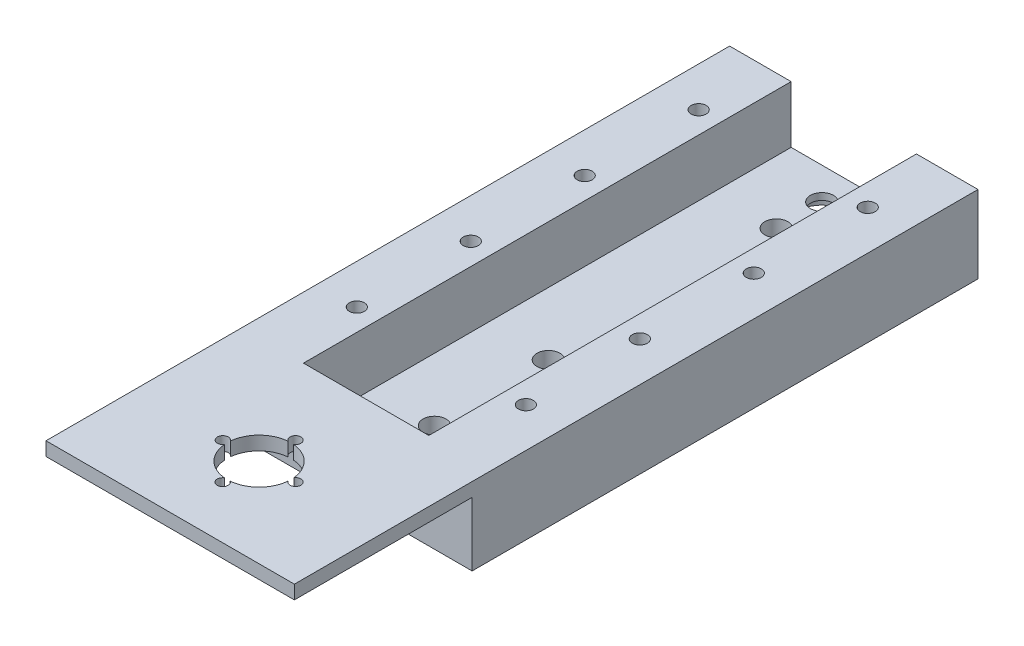
ISO-10303-21;
HEADER;
FILE_DESCRIPTION(('STEP AP214'),'2;1');
FILE_NAME('part.step','',(''),(''),'','','');
FILE_SCHEMA(('AUTOMOTIVE_DESIGN { 1 0 10303 214 1 1 1 1 }'));
ENDSEC;
DATA;
#1=APPLICATION_CONTEXT('core data for automotive mechanical design processes');
#2=APPLICATION_PROTOCOL_DEFINITION('international standard','automotive_design',2000,#1);
#3=PRODUCT_CONTEXT('',#1,'mechanical');
#4=PRODUCT('Part','Part','',(#3));
#5=PRODUCT_RELATED_PRODUCT_CATEGORY('part','',(#4));
#6=PRODUCT_DEFINITION_FORMATION('','',#4);
#7=PRODUCT_DEFINITION_CONTEXT('part definition',#1,'design');
#8=PRODUCT_DEFINITION('design','',#6,#7);
#9=PRODUCT_DEFINITION_SHAPE('','',#8);
#10=(LENGTH_UNIT() NAMED_UNIT(*) SI_UNIT(.MILLI.,.METRE.));
#11=(NAMED_UNIT(*) PLANE_ANGLE_UNIT() SI_UNIT($,.RADIAN.));
#12=(NAMED_UNIT(*) SI_UNIT($,.STERADIAN.) SOLID_ANGLE_UNIT());
#13=UNCERTAINTY_MEASURE_WITH_UNIT(LENGTH_MEASURE(1.E-05),#10,'distance_accuracy_value','');
#14=(GEOMETRIC_REPRESENTATION_CONTEXT(3) GLOBAL_UNCERTAINTY_ASSIGNED_CONTEXT((#13)) GLOBAL_UNIT_ASSIGNED_CONTEXT((#10,
#11,#12)) REPRESENTATION_CONTEXT('',''));
#15=CARTESIAN_POINT('',(0.,0.,0.));
#16=DIRECTION('',(0.,0.,1.));
#17=DIRECTION('',(1.,0.,0.));
#18=AXIS2_PLACEMENT_3D('',#15,#16,#17);
#19=CARTESIAN_POINT('',(-13.3995438408786,4.5,-92.6293125841432));
#20=DIRECTION('',(0.,1.,0.));
#21=DIRECTION('',(0.,0.,1.));
#22=AXIS2_PLACEMENT_3D('',#19,#20,#21);
#23=CYLINDRICAL_SURFACE('',#22,2.5273);
#24=CARTESIAN_POINT('',(-13.3995438408786,4.5,-92.6293125841432));
#25=DIRECTION('',(0.,1.,0.));
#26=DIRECTION('',(0.,0.,1.));
#27=AXIS2_PLACEMENT_3D('',#24,#25,#26);
#28=CIRCLE('',#27,2.5273);
#29=CARTESIAN_POINT('',(-13.3995438408786,4.5,-90.1020125841432));
#30=VERTEX_POINT('',#29);
#31=EDGE_CURVE('E165',#30,#30,#28,.T.);
#32=ORIENTED_EDGE('',*,*,#31,.T.);
#33=EDGE_LOOP('',(#32));
#34=FACE_BOUND('',#33,.T.);
#35=CARTESIAN_POINT('',(-13.3995438408786,3.,-92.6293125841432));
#36=DIRECTION('',(0.,-1.,0.));
#37=DIRECTION('',(0.,0.,-1.));
#38=AXIS2_PLACEMENT_3D('',#35,#36,#37);
#39=CIRCLE('',#38,2.5273);
#40=CARTESIAN_POINT('',(-13.3995438408786,3.,-95.1566125841432));
#41=VERTEX_POINT('',#40);
#42=EDGE_CURVE('E38',#41,#41,#39,.F.);
#43=ORIENTED_EDGE('',*,*,#42,.F.);
#44=EDGE_LOOP('',(#43));
#45=FACE_BOUND('',#44,.T.);
#46=ADVANCED_FACE('F34',(#34,#45),#23,.F.);
#47=CARTESIAN_POINT('',(-13.3995438408786,14.,30.8706874158568));
#48=DIRECTION('',(0.,1.,0.));
#49=DIRECTION('',(0.,0.,1.));
#50=AXIS2_PLACEMENT_3D('',#47,#48,#49);
#51=CYLINDRICAL_SURFACE('',#50,7.);
#52=CARTESIAN_POINT('',(-13.3995438408786,14.,30.8706874158568));
#53=DIRECTION('',(0.,1.,0.));
#54=DIRECTION('',(0.,0.,1.));
#55=AXIS2_PLACEMENT_3D('',#52,#53,#54);
#56=CIRCLE('',#55,7.);
#57=CARTESIAN_POINT('',(-20.3703289447228,14.,31.5095575403921));
#58=VERTEX_POINT('',#57);
#59=CARTESIAN_POINT('',(-14.0194178200066,14.,37.8431874158568));
#60=VERTEX_POINT('',#59);
#61=EDGE_CURVE('E173',#58,#60,#56,.T.);
#62=ORIENTED_EDGE('',*,*,#61,.F.);
#63=DIRECTION('',(0.,1.,0.));
#64=VECTOR('',#63,1.);
#65=CARTESIAN_POINT('',(-20.3703289447228,8.5,31.5095575403921));
#66=LINE('',#65,#64);
#67=CARTESIAN_POINT('',(-20.3703289447228,17.,31.5095575403921));
#68=VERTEX_POINT('',#67);
#69=EDGE_CURVE('E50',#58,#68,#66,.T.);
#70=ORIENTED_EDGE('',*,*,#69,.T.);
#71=CARTESIAN_POINT('',(-13.3995438408786,17.,30.8706874158568));
#72=DIRECTION('',(0.,1.,0.));
#73=DIRECTION('',(0.,0.,1.));
#74=AXIS2_PLACEMENT_3D('',#71,#72,#73);
#75=CIRCLE('',#74,7.);
#76=CARTESIAN_POINT('',(-14.0194178200066,17.,37.8431874158568));
#77=VERTEX_POINT('',#76);
#78=EDGE_CURVE('E171',#68,#77,#75,.T.);
#79=ORIENTED_EDGE('',*,*,#78,.T.);
#80=DIRECTION('',(0.,1.,0.));
#81=VECTOR('',#80,1.);
#82=CARTESIAN_POINT('',(-14.0194178200066,8.5,37.8431874158568));
#83=LINE('',#82,#81);
#84=EDGE_CURVE('E214',#77,#60,#83,.F.);
#85=ORIENTED_EDGE('',*,*,#84,.T.);
#86=EDGE_LOOP('',(#62,#70,#79,#85));
#87=FACE_BOUND('',#86,.T.);
#88=ADVANCED_FACE('F169',(#87),#51,.F.);
#89=CARTESIAN_POINT('',(0.,17.,0.));
#90=DIRECTION('',(0.,-1.,0.));
#91=DIRECTION('',(0.,0.,-1.));
#92=AXIS2_PLACEMENT_3D('',#89,#90,#91);
#93=PLANE('',#92);
#94=CARTESIAN_POINT('',(5.15045615912143,17.,-9.1293125841432));
#95=DIRECTION('',(0.,1.,0.));
#96=DIRECTION('',(0.,0.,1.));
#97=AXIS2_PLACEMENT_3D('',#94,#95,#96);
#98=CIRCLE('',#97,1.65);
#99=CARTESIAN_POINT('',(5.15045615912143,17.,-7.4793125841432));
#100=VERTEX_POINT('',#99);
#101=EDGE_CURVE('E308',#100,#100,#98,.T.);
#102=ORIENTED_EDGE('',*,*,#101,.F.);
#103=EDGE_LOOP('',(#102));
#104=FACE_BOUND('',#103,.T.);
#105=CARTESIAN_POINT('',(5.15045615912143,17.,-34.1293125841432));
#106=DIRECTION('',(0.,1.,0.));
#107=DIRECTION('',(0.,0.,1.));
#108=AXIS2_PLACEMENT_3D('',#105,#106,#107);
#109=CIRCLE('',#108,1.65);
#110=CARTESIAN_POINT('',(5.15045615912143,17.,-32.4793125841432));
#111=VERTEX_POINT('',#110);
#112=EDGE_CURVE('E302',#111,#111,#109,.T.);
#113=ORIENTED_EDGE('',*,*,#112,.F.);
#114=EDGE_LOOP('',(#113));
#115=FACE_BOUND('',#114,.T.);
#116=CARTESIAN_POINT('',(5.15045615912143,17.,-59.1293125841432));
#117=DIRECTION('',(0.,1.,0.));
#118=DIRECTION('',(0.,0.,1.));
#119=AXIS2_PLACEMENT_3D('',#116,#117,#118);
#120=CIRCLE('',#119,1.65);
#121=CARTESIAN_POINT('',(5.15045615912143,17.,-57.4793125841432));
#122=VERTEX_POINT('',#121);
#123=EDGE_CURVE('E296',#122,#122,#120,.T.);
#124=ORIENTED_EDGE('',*,*,#123,.F.);
#125=EDGE_LOOP('',(#124));
#126=FACE_BOUND('',#125,.T.);
#127=CARTESIAN_POINT('',(5.15045615912143,17.,-84.1293125841432));
#128=DIRECTION('',(0.,1.,0.));
#129=DIRECTION('',(0.,0.,1.));
#130=AXIS2_PLACEMENT_3D('',#127,#128,#129);
#131=CIRCLE('',#130,1.65);
#132=CARTESIAN_POINT('',(5.15045615912143,17.,-82.4793125841432));
#133=VERTEX_POINT('',#132);
#134=EDGE_CURVE('E290',#133,#133,#131,.T.);
#135=ORIENTED_EDGE('',*,*,#134,.F.);
#136=EDGE_LOOP('',(#135));
#137=FACE_BOUND('',#136,.T.);
#138=DIRECTION('',(0.,0.,1.));
#139=VECTOR('',#138,1.);
#140=CARTESIAN_POINT('',(-40.6495438408786,17.,-99.6293125841432));
#141=LINE('',#140,#139);
#142=CARTESIAN_POINT('',(-40.6495438408786,17.,-99.6293125841432));
#143=VERTEX_POINT('',#142);
#144=CARTESIAN_POINT('',(-40.6495438408786,17.,50.3706874158568));
#145=VERTEX_POINT('',#144);
#146=EDGE_CURVE('E262',#143,#145,#141,.T.);
#147=ORIENTED_EDGE('',*,*,#146,.T.);
#148=DIRECTION('',(-1.,0.,0.));
#149=VECTOR('',#148,1.);
#150=CARTESIAN_POINT('',(-40.6495438408786,17.,50.3706874158568));
#151=LINE('',#150,#149);
#152=CARTESIAN_POINT('',(13.8504561591214,17.,50.3706874158568));
#153=VERTEX_POINT('',#152);
#154=EDGE_CURVE('E350',#153,#145,#151,.T.);
#155=ORIENTED_EDGE('',*,*,#154,.F.);
#156=DIRECTION('',(0.,0.,1.));
#157=VECTOR('',#156,1.);
#158=CARTESIAN_POINT('',(13.8504561591214,17.,-99.6293125841432));
#159=LINE('',#158,#157);
#160=CARTESIAN_POINT('',(13.8504561591214,17.,-99.6293125841432));
#161=VERTEX_POINT('',#160);
#162=EDGE_CURVE('E274',#161,#153,#159,.T.);
#163=ORIENTED_EDGE('',*,*,#162,.F.);
#164=DIRECTION('',(1.,0.,0.));
#165=VECTOR('',#164,1.);
#166=CARTESIAN_POINT('',(0.350456159121413,17.,-99.6293125841432));
#167=LINE('',#166,#165);
#168=CARTESIAN_POINT('',(0.350456159121413,17.,-99.6293125841432));
#169=VERTEX_POINT('',#168);
#170=EDGE_CURVE('E276',#169,#161,#167,.T.);
#171=ORIENTED_EDGE('',*,*,#170,.F.);
#172=DIRECTION('',(0.,0.,1.));
#173=VECTOR('',#172,1.);
#174=CARTESIAN_POINT('',(0.350456159121413,17.,-99.6293125841432));
#175=LINE('',#174,#173);
#176=CARTESIAN_POINT('',(0.350456159121413,17.,7.37068741585679));
#177=VERTEX_POINT('',#176);
#178=EDGE_CURVE('E279',#169,#177,#175,.T.);
#179=ORIENTED_EDGE('',*,*,#178,.T.);
#180=DIRECTION('',(-1.,0.,0.));
#181=VECTOR('',#180,1.);
#182=CARTESIAN_POINT('',(9.85045615912145,17.,7.37068741585679));
#183=LINE('',#182,#181);
#184=CARTESIAN_POINT('',(-27.1495438408786,17.,7.3706874158568));
#185=VERTEX_POINT('',#184);
#186=EDGE_CURVE('E339',#177,#185,#183,.T.);
#187=ORIENTED_EDGE('',*,*,#186,.T.);
#188=DIRECTION('',(0.,0.,1.));
#189=VECTOR('',#188,1.);
#190=CARTESIAN_POINT('',(-27.1495438408786,17.,-99.6293125841432));
#191=LINE('',#190,#189);
#192=CARTESIAN_POINT('',(-27.1495438408786,17.,-99.6293125841432));
#193=VERTEX_POINT('',#192);
#194=EDGE_CURVE('E266',#193,#185,#191,.T.);
#195=ORIENTED_EDGE('',*,*,#194,.F.);
#196=DIRECTION('',(1.,0.,0.));
#197=VECTOR('',#196,1.);
#198=CARTESIAN_POINT('',(-40.6495438408786,17.,-99.6293125841432));
#199=LINE('',#198,#197);
#200=EDGE_CURVE('E269',#143,#193,#199,.T.);
#201=ORIENTED_EDGE('',*,*,#200,.F.);
#202=EDGE_LOOP('',(#147,#155,#163,#171,#179,#187,#195,#201));
#203=FACE_BOUND('',#202,.T.);
#204=CARTESIAN_POINT('',(-31.9495438408786,17.,-84.1293125841432));
#205=DIRECTION('',(0.,1.,0.));
#206=DIRECTION('',(0.,0.,1.));
#207=AXIS2_PLACEMENT_3D('',#204,#205,#206);
#208=CIRCLE('',#207,1.65);
#209=CARTESIAN_POINT('',(-31.9495438408786,17.,-82.4793125841432));
#210=VERTEX_POINT('',#209);
#211=EDGE_CURVE('E314',#210,#210,#208,.T.);
#212=ORIENTED_EDGE('',*,*,#211,.F.);
#213=EDGE_LOOP('',(#212));
#214=FACE_BOUND('',#213,.T.);
#215=CARTESIAN_POINT('',(-31.9495438408786,17.,-59.1293125841432));
#216=DIRECTION('',(0.,1.,0.));
#217=DIRECTION('',(0.,0.,1.));
#218=AXIS2_PLACEMENT_3D('',#215,#216,#217);
#219=CIRCLE('',#218,1.65);
#220=CARTESIAN_POINT('',(-31.9495438408786,17.,-57.4793125841432));
#221=VERTEX_POINT('',#220);
#222=EDGE_CURVE('E320',#221,#221,#219,.T.);
#223=ORIENTED_EDGE('',*,*,#222,.F.);
#224=EDGE_LOOP('',(#223));
#225=FACE_BOUND('',#224,.T.);
#226=CARTESIAN_POINT('',(-31.9495438408786,17.,-34.1293125841432));
#227=DIRECTION('',(0.,1.,0.));
#228=DIRECTION('',(0.,0.,1.));
#229=AXIS2_PLACEMENT_3D('',#226,#227,#228);
#230=CIRCLE('',#229,1.65);
#231=CARTESIAN_POINT('',(-31.9495438408786,17.,-32.4793125841432));
#232=VERTEX_POINT('',#231);
#233=EDGE_CURVE('E326',#232,#232,#230,.T.);
#234=ORIENTED_EDGE('',*,*,#233,.F.);
#235=EDGE_LOOP('',(#234));
#236=FACE_BOUND('',#235,.T.);
#237=CARTESIAN_POINT('',(-31.9495438408786,17.,-9.1293125841432));
#238=DIRECTION('',(0.,1.,0.));
#239=DIRECTION('',(0.,0.,1.));
#240=AXIS2_PLACEMENT_3D('',#237,#238,#239);
#241=CIRCLE('',#240,1.65);
#242=CARTESIAN_POINT('',(-31.9495438408786,17.,-7.4793125841432));
#243=VERTEX_POINT('',#242);
#244=EDGE_CURVE('E332',#243,#243,#241,.T.);
#245=ORIENTED_EDGE('',*,*,#244,.F.);
#246=EDGE_LOOP('',(#245));
#247=FACE_BOUND('',#246,.T.);
#248=CARTESIAN_POINT('',(-21.3714371180351,17.,30.8479062535898));
#249=DIRECTION('',(0.,1.,0.));
#250=DIRECTION('',(0.,0.,1.));
#251=AXIS2_PLACEMENT_3D('',#248,#249,#250);
#252=CIRCLE('',#251,1.2);
#253=CARTESIAN_POINT('',(-20.3665637439829,17.,30.1919874307764));
#254=VERTEX_POINT('',#253);
#255=EDGE_CURVE('E157',#254,#68,#252,.T.);
#256=ORIENTED_EDGE('',*,*,#255,.F.);
#257=CARTESIAN_POINT('',(-14.0194178200066,17.,23.8981874158568));
#258=VERTEX_POINT('',#257);
#259=EDGE_CURVE('E180',#258,#254,#75,.T.);
#260=ORIENTED_EDGE('',*,*,#259,.F.);
#261=CARTESIAN_POINT('',(-13.3995438408786,17.,22.8706874158568));
#262=DIRECTION('',(0.,1.,0.));
#263=DIRECTION('',(0.,0.,1.));
#264=AXIS2_PLACEMENT_3D('',#261,#262,#263);
#265=CIRCLE('',#264,1.2);
#266=CARTESIAN_POINT('',(-12.7796698617505,17.,23.8981874158568));
#267=VERTEX_POINT('',#266);
#268=EDGE_CURVE('E174',#267,#258,#265,.T.);
#269=ORIENTED_EDGE('',*,*,#268,.F.);
#270=CARTESIAN_POINT('',(-6.43313001042027,17.,30.1857944732743));
#271=VERTEX_POINT('',#270);
#272=EDGE_CURVE('E183',#271,#267,#75,.T.);
#273=ORIENTED_EDGE('',*,*,#272,.F.);
#274=CARTESIAN_POINT('',(-5.43047554219228,17.,30.8451001818363));
#275=DIRECTION('',(0.,1.,0.));
#276=DIRECTION('',(0.,0.,1.));
#277=AXIS2_PLACEMENT_3D('',#274,#275,#276);
#278=CIRCLE('',#277,1.2);
#279=CARTESIAN_POINT('',(-6.42887555855517,17.,31.5108309136841));
#280=VERTEX_POINT('',#279);
#281=EDGE_CURVE('E221',#280,#271,#278,.T.);
#282=ORIENTED_EDGE('',*,*,#281,.F.);
#283=CARTESIAN_POINT('',(-12.7796698617506,17.,37.8431874158568));
#284=VERTEX_POINT('',#283);
#285=EDGE_CURVE('E181',#284,#280,#75,.T.);
#286=ORIENTED_EDGE('',*,*,#285,.F.);
#287=CARTESIAN_POINT('',(-13.3995438408786,17.,38.8706874158568));
#288=DIRECTION('',(0.,-1.,0.));
#289=DIRECTION('',(0.,0.,-1.));
#290=AXIS2_PLACEMENT_3D('',#287,#288,#289);
#291=CIRCLE('',#290,1.2);
#292=EDGE_CURVE('E179',#284,#77,#291,.T.);
#293=ORIENTED_EDGE('',*,*,#292,.T.);
#294=ORIENTED_EDGE('',*,*,#78,.F.);
#295=EDGE_LOOP('',(#256,#260,#269,#273,#282,#286,#293,#294));
#296=FACE_BOUND('',#295,.T.);
#297=ADVANCED_FACE('F177',(#104,#115,#126,#137,#203,#214,#225,#236,#247,#296),#93,.F.);
#298=ORIENTED_EDGE('',*,*,#259,.T.);
#299=DIRECTION('',(0.,1.,0.));
#300=VECTOR('',#299,1.);
#301=CARTESIAN_POINT('',(-20.3665637439829,8.5,30.1919874307764));
#302=LINE('',#301,#300);
#303=CARTESIAN_POINT('',(-20.3665637439829,14.,30.1919874307764));
#304=VERTEX_POINT('',#303);
#305=EDGE_CURVE('E160',#254,#304,#302,.F.);
#306=ORIENTED_EDGE('',*,*,#305,.T.);
#307=CARTESIAN_POINT('',(-14.0194178200066,14.,23.8981874158568));
#308=VERTEX_POINT('',#307);
#309=EDGE_CURVE('E193',#308,#304,#56,.T.);
#310=ORIENTED_EDGE('',*,*,#309,.F.);
#311=DIRECTION('',(0.,1.,0.));
#312=VECTOR('',#311,1.);
#313=CARTESIAN_POINT('',(-14.0194178200066,8.5,23.8981874158568));
#314=LINE('',#313,#312);
#315=EDGE_CURVE('E43',#308,#258,#314,.T.);
#316=ORIENTED_EDGE('',*,*,#315,.T.);
#317=EDGE_LOOP('',(#298,#306,#310,#316));
#318=FACE_BOUND('',#317,.T.);
#319=ADVANCED_FACE('F208',(#318),#51,.F.);
#320=CARTESIAN_POINT('',(-12.7796698617506,14.,37.8431874158568));
#321=VERTEX_POINT('',#320);
#322=CARTESIAN_POINT('',(-6.42887555855517,14.,31.5108309136841));
#323=VERTEX_POINT('',#322);
#324=EDGE_CURVE('E188',#321,#323,#56,.T.);
#325=ORIENTED_EDGE('',*,*,#324,.F.);
#326=DIRECTION('',(0.,1.,0.));
#327=VECTOR('',#326,1.);
#328=CARTESIAN_POINT('',(-12.7796698617506,8.5,37.8431874158568));
#329=LINE('',#328,#327);
#330=EDGE_CURVE('E218',#321,#284,#329,.T.);
#331=ORIENTED_EDGE('',*,*,#330,.T.);
#332=ORIENTED_EDGE('',*,*,#285,.T.);
#333=DIRECTION('',(0.,1.,0.));
#334=VECTOR('',#333,1.);
#335=CARTESIAN_POINT('',(-6.42887555855517,8.5,31.5108309136841));
#336=LINE('',#335,#334);
#337=EDGE_CURVE('E235',#280,#323,#336,.F.);
#338=ORIENTED_EDGE('',*,*,#337,.T.);
#339=EDGE_LOOP('',(#325,#331,#332,#338));
#340=FACE_BOUND('',#339,.T.);
#341=ADVANCED_FACE('F439',(#340),#51,.F.);
#342=CARTESIAN_POINT('',(-40.6495438408786,4.5,11.3706874158568));
#343=DIRECTION('',(0.,0.,-1.));
#344=DIRECTION('',(-1.,0.,0.));
#345=AXIS2_PLACEMENT_3D('',#342,#343,#344);
#346=PLANE('',#345);
#347=DIRECTION('',(1.,0.,0.));
#348=VECTOR('',#347,1.);
#349=CARTESIAN_POINT('',(-40.6495438408786,14.,11.3706874158568));
#350=LINE('',#349,#348);
#351=CARTESIAN_POINT('',(-40.6495438408786,14.,11.3706874158568));
#352=VERTEX_POINT('',#351);
#353=CARTESIAN_POINT('',(13.8504561591214,14.,11.3706874158568));
#354=VERTEX_POINT('',#353);
#355=EDGE_CURVE('E201',#352,#354,#350,.T.);
#356=ORIENTED_EDGE('',*,*,#355,.F.);
#357=DIRECTION('',(0.,-1.,0.));
#358=VECTOR('',#357,1.);
#359=CARTESIAN_POINT('',(-40.6495438408786,4.5,11.3706874158568));
#360=LINE('',#359,#358);
#361=CARTESIAN_POINT('',(-40.6495438408786,0.,11.3706874158568));
#362=VERTEX_POINT('',#361);
#363=EDGE_CURVE('E237',#352,#362,#360,.T.);
#364=ORIENTED_EDGE('',*,*,#363,.T.);
#365=DIRECTION('',(1.,0.,0.));
#366=VECTOR('',#365,1.);
#367=CARTESIAN_POINT('',(-40.6495438408786,0.,11.3706874158568));
#368=LINE('',#367,#366);
#369=CARTESIAN_POINT('',(13.8504561591214,0.,11.3706874158568));
#370=VERTEX_POINT('',#369);
#371=EDGE_CURVE('E252',#362,#370,#368,.T.);
#372=ORIENTED_EDGE('',*,*,#371,.T.);
#373=DIRECTION('',(0.,-1.,0.));
#374=VECTOR('',#373,1.);
#375=CARTESIAN_POINT('',(13.8504561591214,4.5,11.3706874158568));
#376=LINE('',#375,#374);
#377=EDGE_CURVE('E239',#354,#370,#376,.T.);
#378=ORIENTED_EDGE('',*,*,#377,.F.);
#379=EDGE_LOOP('',(#356,#364,#372,#378));
#380=FACE_BOUND('',#379,.T.);
#381=ADVANCED_FACE('F387',(#380),#346,.F.);
#382=CARTESIAN_POINT('',(0.,4.5,0.));
#383=DIRECTION('',(0.,-1.,0.));
#384=DIRECTION('',(0.,0.,-1.));
#385=AXIS2_PLACEMENT_3D('',#382,#383,#384);
#386=PLANE('',#385);
#387=CARTESIAN_POINT('',(-13.3995438408786,4.5,2.37068741585679));
#388=DIRECTION('',(0.,1.,0.));
#389=DIRECTION('',(0.,0.,1.));
#390=AXIS2_PLACEMENT_3D('',#387,#388,#389);
#391=CIRCLE('',#390,2.5273);
#392=CARTESIAN_POINT('',(-13.3995438408786,4.5,4.89798741585679));
#393=VERTEX_POINT('',#392);
#394=EDGE_CURVE('E574',#393,#393,#391,.T.);
#395=ORIENTED_EDGE('',*,*,#394,.F.);
#396=EDGE_LOOP('',(#395));
#397=FACE_BOUND('',#396,.T.);
#398=CARTESIAN_POINT('',(-13.3995438408786,4.5,-7.62931258414321));
#399=DIRECTION('',(0.,1.,0.));
#400=DIRECTION('',(0.,0.,1.));
#401=AXIS2_PLACEMENT_3D('',#398,#399,#400);
#402=CIRCLE('',#401,2.5273);
#403=CARTESIAN_POINT('',(-13.3995438408786,4.5,-5.10201258414321));
#404=VERTEX_POINT('',#403);
#405=EDGE_CURVE('E570',#404,#404,#402,.T.);
#406=ORIENTED_EDGE('',*,*,#405,.F.);
#407=EDGE_LOOP('',(#406));
#408=FACE_BOUND('',#407,.T.);
#409=CARTESIAN_POINT('',(-13.3995438408786,4.5,-32.6293125841432));
#410=DIRECTION('',(0.,1.,0.));
#411=DIRECTION('',(0.,0.,1.));
#412=AXIS2_PLACEMENT_3D('',#409,#410,#411);
#413=CIRCLE('',#412,2.5273);
#414=CARTESIAN_POINT('',(-13.3995438408786,4.5,-30.1020125841432));
#415=VERTEX_POINT('',#414);
#416=EDGE_CURVE('E566',#415,#415,#413,.T.);
#417=ORIENTED_EDGE('',*,*,#416,.F.);
#418=EDGE_LOOP('',(#417));
#419=FACE_BOUND('',#418,.T.);
#420=CARTESIAN_POINT('',(-13.3995438408786,4.5,-82.6293125841432));
#421=DIRECTION('',(0.,1.,0.));
#422=DIRECTION('',(0.,0.,1.));
#423=AXIS2_PLACEMENT_3D('',#420,#421,#422);
#424=CIRCLE('',#423,2.5273);
#425=CARTESIAN_POINT('',(-13.3995438408786,4.5,-80.1020125841432));
#426=VERTEX_POINT('',#425);
#427=EDGE_CURVE('E560',#426,#426,#424,.T.);
#428=ORIENTED_EDGE('',*,*,#427,.F.);
#429=EDGE_LOOP('',(#428));
#430=FACE_BOUND('',#429,.T.);
#431=ORIENTED_EDGE('',*,*,#31,.F.);
#432=EDGE_LOOP('',(#431));
#433=FACE_BOUND('',#432,.T.);
#434=DIRECTION('',(-1.,0.,0.));
#435=VECTOR('',#434,1.);
#436=CARTESIAN_POINT('',(9.85045615912145,4.5,7.37068741585679));
#437=LINE('',#436,#435);
#438=CARTESIAN_POINT('',(0.350456159121427,4.5,7.37068741585679));
#439=VERTEX_POINT('',#438);
#440=CARTESIAN_POINT('',(-27.1495438408786,4.5,7.3706874158568));
#441=VERTEX_POINT('',#440);
#442=EDGE_CURVE('E337',#439,#441,#437,.T.);
#443=ORIENTED_EDGE('',*,*,#442,.F.);
#444=DIRECTION('',(0.,0.,1.));
#445=VECTOR('',#444,1.);
#446=CARTESIAN_POINT('',(0.350456159121413,4.5,-99.6293125841432));
#447=LINE('',#446,#445);
#448=CARTESIAN_POINT('',(0.350456159121423,4.5,-99.6293125841432));
#449=VERTEX_POINT('',#448);
#450=EDGE_CURVE('E267',#449,#439,#447,.T.);
#451=ORIENTED_EDGE('',*,*,#450,.F.);
#452=DIRECTION('',(-1.,0.,0.));
#453=VECTOR('',#452,1.);
#454=CARTESIAN_POINT('',(-40.6495438408786,4.5,-99.6293125841432));
#455=LINE('',#454,#453);
#456=CARTESIAN_POINT('',(-27.1495438408786,4.5,-99.6293125841432));
#457=VERTEX_POINT('',#456);
#458=EDGE_CURVE('E247',#449,#457,#455,.T.);
#459=ORIENTED_EDGE('',*,*,#458,.T.);
#460=DIRECTION('',(0.,0.,1.));
#461=VECTOR('',#460,1.);
#462=CARTESIAN_POINT('',(-27.1495438408786,4.5,-99.6293125841432));
#463=LINE('',#462,#461);
#464=EDGE_CURVE('E263',#457,#441,#463,.T.);
#465=ORIENTED_EDGE('',*,*,#464,.T.);
#466=EDGE_LOOP('',(#443,#451,#459,#465));
#467=FACE_BOUND('',#466,.T.);
#468=ADVANCED_FACE('F399',(#397,#408,#419,#430,#433,#467),#386,.F.);
#469=CARTESIAN_POINT('',(-27.1495438408786,17.,-99.6293125841432));
#470=DIRECTION('',(1.,0.,0.));
#471=DIRECTION('',(0.,0.,-1.));
#472=AXIS2_PLACEMENT_3D('',#469,#470,#471);
#473=PLANE('',#472);
#474=ORIENTED_EDGE('',*,*,#194,.T.);
#475=DIRECTION('',(0.,1.,0.));
#476=VECTOR('',#475,1.);
#477=CARTESIAN_POINT('',(-27.1495438408786,17.,7.3706874158568));
#478=LINE('',#477,#476);
#479=EDGE_CURVE('E341',#441,#185,#478,.T.);
#480=ORIENTED_EDGE('',*,*,#479,.F.);
#481=ORIENTED_EDGE('',*,*,#464,.F.);
#482=DIRECTION('',(0.,-1.,0.));
#483=VECTOR('',#482,1.);
#484=CARTESIAN_POINT('',(-27.1495438408786,17.,-99.6293125841432));
#485=LINE('',#484,#483);
#486=EDGE_CURVE('E258',#193,#457,#485,.T.);
#487=ORIENTED_EDGE('',*,*,#486,.F.);
#488=EDGE_LOOP('',(#474,#480,#481,#487));
#489=FACE_BOUND('',#488,.T.);
#490=ADVANCED_FACE('F402',(#489),#473,.T.);
#491=CARTESIAN_POINT('',(0.350456159121413,17.,-99.6293125841432));
#492=DIRECTION('',(1.,0.,0.));
#493=DIRECTION('',(0.,0.,-1.));
#494=AXIS2_PLACEMENT_3D('',#491,#492,#493);
#495=PLANE('',#494);
#496=DIRECTION('',(0.,-1.,0.));
#497=VECTOR('',#496,1.);
#498=CARTESIAN_POINT('',(0.350456159121426,17.,7.37068741585679));
#499=LINE('',#498,#497);
#500=EDGE_CURVE('E335',#177,#439,#499,.T.);
#501=ORIENTED_EDGE('',*,*,#500,.F.);
#502=ORIENTED_EDGE('',*,*,#178,.F.);
#503=DIRECTION('',(0.,-1.,0.));
#504=VECTOR('',#503,1.);
#505=CARTESIAN_POINT('',(0.350456159121413,17.,-99.6293125841432));
#506=LINE('',#505,#504);
#507=EDGE_CURVE('E282',#169,#449,#506,.T.);
#508=ORIENTED_EDGE('',*,*,#507,.T.);
#509=ORIENTED_EDGE('',*,*,#450,.T.);
#510=EDGE_LOOP('',(#501,#502,#508,#509));
#511=FACE_BOUND('',#510,.T.);
#512=ADVANCED_FACE('F393',(#511),#495,.F.);
#513=CARTESIAN_POINT('',(-40.6495438408786,4.5,11.3706874158568));
#514=DIRECTION('',(1.,0.,0.));
#515=DIRECTION('',(0.,0.,-1.));
#516=AXIS2_PLACEMENT_3D('',#513,#514,#515);
#517=PLANE('',#516);
#518=DIRECTION('',(0.,0.,1.));
#519=VECTOR('',#518,1.);
#520=CARTESIAN_POINT('',(-40.6495438408786,0.,11.3706874158568));
#521=LINE('',#520,#519);
#522=CARTESIAN_POINT('',(-40.6495438408786,0.,-99.6293125841432));
#523=VERTEX_POINT('',#522);
#524=EDGE_CURVE('E255',#523,#362,#521,.T.);
#525=ORIENTED_EDGE('',*,*,#524,.T.);
#526=ORIENTED_EDGE('',*,*,#363,.F.);
#527=DIRECTION('',(0.,0.,-1.));
#528=VECTOR('',#527,1.);
#529=CARTESIAN_POINT('',(-40.6495438408786,14.,50.3706874158568));
#530=LINE('',#529,#528);
#531=CARTESIAN_POINT('',(-40.6495438408786,14.,50.3706874158568));
#532=VERTEX_POINT('',#531);
#533=EDGE_CURVE('E344',#532,#352,#530,.T.);
#534=ORIENTED_EDGE('',*,*,#533,.F.);
#535=DIRECTION('',(0.,-1.,0.));
#536=VECTOR('',#535,1.);
#537=CARTESIAN_POINT('',(-40.6495438408786,17.,50.3706874158568));
#538=LINE('',#537,#536);
#539=EDGE_CURVE('E353',#145,#532,#538,.T.);
#540=ORIENTED_EDGE('',*,*,#539,.F.);
#541=ORIENTED_EDGE('',*,*,#146,.F.);
#542=DIRECTION('',(0.,-1.,0.));
#543=VECTOR('',#542,1.);
#544=CARTESIAN_POINT('',(-40.6495438408786,4.5,-99.6293125841432));
#545=LINE('',#544,#543);
#546=EDGE_CURVE('E244',#143,#523,#545,.T.);
#547=ORIENTED_EDGE('',*,*,#546,.T.);
#548=EDGE_LOOP('',(#525,#526,#534,#540,#541,#547));
#549=FACE_BOUND('',#548,.T.);
#550=ADVANCED_FACE('F36',(#549),#517,.F.);
#551=CARTESIAN_POINT('',(13.8504561591214,4.5,11.3706874158568));
#552=DIRECTION('',(-1.,0.,0.));
#553=DIRECTION('',(0.,0.,1.));
#554=AXIS2_PLACEMENT_3D('',#551,#552,#553);
#555=PLANE('',#554);
#556=DIRECTION('',(0.,0.,-1.));
#557=VECTOR('',#556,1.);
#558=CARTESIAN_POINT('',(13.8504561591214,0.,11.3706874158568));
#559=LINE('',#558,#557);
#560=CARTESIAN_POINT('',(13.8504561591214,0.,-99.6293125841432));
#561=VERTEX_POINT('',#560);
#562=EDGE_CURVE('E250',#370,#561,#559,.T.);
#563=ORIENTED_EDGE('',*,*,#562,.T.);
#564=DIRECTION('',(0.,-1.,0.));
#565=VECTOR('',#564,1.);
#566=CARTESIAN_POINT('',(13.8504561591214,4.5,-99.6293125841432));
#567=LINE('',#566,#565);
#568=EDGE_CURVE('E241',#161,#561,#567,.T.);
#569=ORIENTED_EDGE('',*,*,#568,.F.);
#570=ORIENTED_EDGE('',*,*,#162,.T.);
#571=DIRECTION('',(0.,1.,0.));
#572=VECTOR('',#571,1.);
#573=CARTESIAN_POINT('',(13.8504561591214,17.,50.3706874158568));
#574=LINE('',#573,#572);
#575=CARTESIAN_POINT('',(13.8504561591214,14.,50.3706874158568));
#576=VERTEX_POINT('',#575);
#577=EDGE_CURVE('E356',#576,#153,#574,.T.);
#578=ORIENTED_EDGE('',*,*,#577,.F.);
#579=DIRECTION('',(0.,0.,-1.));
#580=VECTOR('',#579,1.);
#581=CARTESIAN_POINT('',(13.8504561591214,14.,50.3706874158568));
#582=LINE('',#581,#580);
#583=EDGE_CURVE('E347',#576,#354,#582,.T.);
#584=ORIENTED_EDGE('',*,*,#583,.T.);
#585=ORIENTED_EDGE('',*,*,#377,.T.);
#586=EDGE_LOOP('',(#563,#569,#570,#578,#584,#585));
#587=FACE_BOUND('',#586,.T.);
#588=ADVANCED_FACE('F372',(#587),#555,.F.);
#589=CARTESIAN_POINT('',(-40.6495438408786,4.5,-99.6293125841432));
#590=DIRECTION('',(0.,0.,1.));
#591=DIRECTION('',(1.,0.,0.));
#592=AXIS2_PLACEMENT_3D('',#589,#590,#591);
#593=PLANE('',#592);
#594=DIRECTION('',(-1.,0.,0.));
#595=VECTOR('',#594,1.);
#596=CARTESIAN_POINT('',(-40.6495438408786,0.,-99.6293125841432));
#597=LINE('',#596,#595);
#598=EDGE_CURVE('E248',#561,#523,#597,.T.);
#599=ORIENTED_EDGE('',*,*,#598,.T.);
#600=ORIENTED_EDGE('',*,*,#546,.F.);
#601=ORIENTED_EDGE('',*,*,#200,.T.);
#602=ORIENTED_EDGE('',*,*,#486,.T.);
#603=ORIENTED_EDGE('',*,*,#458,.F.);
#604=ORIENTED_EDGE('',*,*,#507,.F.);
#605=ORIENTED_EDGE('',*,*,#170,.T.);
#606=ORIENTED_EDGE('',*,*,#568,.T.);
#607=EDGE_LOOP('',(#599,#600,#601,#602,#603,#604,#605,#606));
#608=FACE_BOUND('',#607,.T.);
#609=ADVANCED_FACE('F388',(#608),#593,.F.);
#610=CARTESIAN_POINT('',(0.,0.,0.));
#611=DIRECTION('',(0.,-1.,0.));
#612=DIRECTION('',(0.,0.,-1.));
#613=AXIS2_PLACEMENT_3D('',#610,#611,#612);
#614=PLANE('',#613);
#615=CARTESIAN_POINT('',(-13.3995438408786,0.,-92.6293125841432));
#616=DIRECTION('',(0.,-1.,0.));
#617=DIRECTION('',(0.,0.,-1.));
#618=AXIS2_PLACEMENT_3D('',#615,#616,#617);
#619=CIRCLE('',#618,5.5);
#620=CARTESIAN_POINT('',(-13.3995438408786,0.,-98.1293125841432));
#621=VERTEX_POINT('',#620);
#622=EDGE_CURVE('E516',#621,#621,#619,.T.);
#623=ORIENTED_EDGE('',*,*,#622,.F.);
#624=EDGE_LOOP('',(#623));
#625=FACE_BOUND('',#624,.T.);
#626=CARTESIAN_POINT('',(-13.3995438408786,0.,2.37068741585679));
#627=DIRECTION('',(0.,1.,0.));
#628=DIRECTION('',(0.,0.,1.));
#629=AXIS2_PLACEMENT_3D('',#626,#627,#628);
#630=CIRCLE('',#629,2.5273);
#631=CARTESIAN_POINT('',(-13.3995438408786,0.,4.89798741585679));
#632=VERTEX_POINT('',#631);
#633=EDGE_CURVE('E520',#632,#632,#630,.T.);
#634=ORIENTED_EDGE('',*,*,#633,.T.);
#635=EDGE_LOOP('',(#634));
#636=FACE_BOUND('',#635,.T.);
#637=CARTESIAN_POINT('',(-13.3995438408786,0.,-7.62931258414321));
#638=DIRECTION('',(0.,1.,0.));
#639=DIRECTION('',(0.,0.,1.));
#640=AXIS2_PLACEMENT_3D('',#637,#638,#639);
#641=CIRCLE('',#640,2.5273);
#642=CARTESIAN_POINT('',(-13.3995438408786,0.,-5.10201258414321));
#643=VERTEX_POINT('',#642);
#644=EDGE_CURVE('E524',#643,#643,#641,.T.);
#645=ORIENTED_EDGE('',*,*,#644,.T.);
#646=EDGE_LOOP('',(#645));
#647=FACE_BOUND('',#646,.T.);
#648=CARTESIAN_POINT('',(-13.3995438408786,0.,-32.6293125841432));
#649=DIRECTION('',(0.,1.,0.));
#650=DIRECTION('',(0.,0.,1.));
#651=AXIS2_PLACEMENT_3D('',#648,#649,#650);
#652=CIRCLE('',#651,2.5273);
#653=CARTESIAN_POINT('',(-13.3995438408786,0.,-30.1020125841432));
#654=VERTEX_POINT('',#653);
#655=EDGE_CURVE('E528',#654,#654,#652,.T.);
#656=ORIENTED_EDGE('',*,*,#655,.T.);
#657=EDGE_LOOP('',(#656));
#658=FACE_BOUND('',#657,.T.);
#659=CARTESIAN_POINT('',(-13.3995438408786,0.,-82.6293125841432));
#660=DIRECTION('',(0.,1.,0.));
#661=DIRECTION('',(0.,0.,1.));
#662=AXIS2_PLACEMENT_3D('',#659,#660,#661);
#663=CIRCLE('',#662,2.5273);
#664=CARTESIAN_POINT('',(-13.3995438408786,0.,-80.1020125841432));
#665=VERTEX_POINT('',#664);
#666=EDGE_CURVE('E532',#665,#665,#663,.T.);
#667=ORIENTED_EDGE('',*,*,#666,.T.);
#668=EDGE_LOOP('',(#667));
#669=FACE_BOUND('',#668,.T.);
#670=CARTESIAN_POINT('',(-31.9495438408786,0.,-9.1293125841432));
#671=DIRECTION('',(0.,1.,0.));
#672=DIRECTION('',(0.,0.,1.));
#673=AXIS2_PLACEMENT_3D('',#670,#671,#672);
#674=CIRCLE('',#673,1.65);
#675=CARTESIAN_POINT('',(-31.9495438408786,0.,-7.4793125841432));
#676=VERTEX_POINT('',#675);
#677=EDGE_CURVE('E329',#676,#676,#674,.T.);
#678=ORIENTED_EDGE('',*,*,#677,.T.);
#679=EDGE_LOOP('',(#678));
#680=FACE_BOUND('',#679,.T.);
#681=CARTESIAN_POINT('',(-31.9495438408786,0.,-34.1293125841432));
#682=DIRECTION('',(0.,1.,0.));
#683=DIRECTION('',(0.,0.,1.));
#684=AXIS2_PLACEMENT_3D('',#681,#682,#683);
#685=CIRCLE('',#684,1.65);
#686=CARTESIAN_POINT('',(-31.9495438408786,0.,-32.4793125841432));
#687=VERTEX_POINT('',#686);
#688=EDGE_CURVE('E323',#687,#687,#685,.T.);
#689=ORIENTED_EDGE('',*,*,#688,.T.);
#690=EDGE_LOOP('',(#689));
#691=FACE_BOUND('',#690,.T.);
#692=CARTESIAN_POINT('',(-31.9495438408786,0.,-59.1293125841432));
#693=DIRECTION('',(0.,1.,0.));
#694=DIRECTION('',(0.,0.,1.));
#695=AXIS2_PLACEMENT_3D('',#692,#693,#694);
#696=CIRCLE('',#695,1.65);
#697=CARTESIAN_POINT('',(-31.9495438408786,0.,-57.4793125841432));
#698=VERTEX_POINT('',#697);
#699=EDGE_CURVE('E317',#698,#698,#696,.T.);
#700=ORIENTED_EDGE('',*,*,#699,.T.);
#701=EDGE_LOOP('',(#700));
#702=FACE_BOUND('',#701,.T.);
#703=CARTESIAN_POINT('',(-31.9495438408786,0.,-84.1293125841432));
#704=DIRECTION('',(0.,1.,0.));
#705=DIRECTION('',(0.,0.,1.));
#706=AXIS2_PLACEMENT_3D('',#703,#704,#705);
#707=CIRCLE('',#706,1.65);
#708=CARTESIAN_POINT('',(-31.9495438408786,0.,-82.4793125841432));
#709=VERTEX_POINT('',#708);
#710=EDGE_CURVE('E311',#709,#709,#707,.T.);
#711=ORIENTED_EDGE('',*,*,#710,.T.);
#712=EDGE_LOOP('',(#711));
#713=FACE_BOUND('',#712,.T.);
#714=CARTESIAN_POINT('',(5.15045615912143,0.,-9.1293125841432));
#715=DIRECTION('',(0.,1.,0.));
#716=DIRECTION('',(0.,0.,1.));
#717=AXIS2_PLACEMENT_3D('',#714,#715,#716);
#718=CIRCLE('',#717,1.65);
#719=CARTESIAN_POINT('',(5.15045615912143,0.,-7.4793125841432));
#720=VERTEX_POINT('',#719);
#721=EDGE_CURVE('E305',#720,#720,#718,.T.);
#722=ORIENTED_EDGE('',*,*,#721,.T.);
#723=EDGE_LOOP('',(#722));
#724=FACE_BOUND('',#723,.T.);
#725=CARTESIAN_POINT('',(5.15045615912143,0.,-34.1293125841432));
#726=DIRECTION('',(0.,1.,0.));
#727=DIRECTION('',(0.,0.,1.));
#728=AXIS2_PLACEMENT_3D('',#725,#726,#727);
#729=CIRCLE('',#728,1.65);
#730=CARTESIAN_POINT('',(5.15045615912143,0.,-32.4793125841432));
#731=VERTEX_POINT('',#730);
#732=EDGE_CURVE('E299',#731,#731,#729,.T.);
#733=ORIENTED_EDGE('',*,*,#732,.T.);
#734=EDGE_LOOP('',(#733));
#735=FACE_BOUND('',#734,.T.);
#736=CARTESIAN_POINT('',(5.15045615912143,0.,-59.1293125841432));
#737=DIRECTION('',(0.,1.,0.));
#738=DIRECTION('',(0.,0.,1.));
#739=AXIS2_PLACEMENT_3D('',#736,#737,#738);
#740=CIRCLE('',#739,1.65);
#741=CARTESIAN_POINT('',(5.15045615912143,0.,-57.4793125841432));
#742=VERTEX_POINT('',#741);
#743=EDGE_CURVE('E293',#742,#742,#740,.T.);
#744=ORIENTED_EDGE('',*,*,#743,.T.);
#745=EDGE_LOOP('',(#744));
#746=FACE_BOUND('',#745,.T.);
#747=CARTESIAN_POINT('',(5.15045615912143,0.,-84.1293125841432));
#748=DIRECTION('',(0.,1.,0.));
#749=DIRECTION('',(0.,0.,1.));
#750=AXIS2_PLACEMENT_3D('',#747,#748,#749);
#751=CIRCLE('',#750,1.65);
#752=CARTESIAN_POINT('',(5.15045615912143,0.,-82.4793125841432));
#753=VERTEX_POINT('',#752);
#754=EDGE_CURVE('E287',#753,#753,#751,.T.);
#755=ORIENTED_EDGE('',*,*,#754,.T.);
#756=EDGE_LOOP('',(#755));
#757=FACE_BOUND('',#756,.T.);
#758=ORIENTED_EDGE('',*,*,#524,.F.);
#759=ORIENTED_EDGE('',*,*,#598,.F.);
#760=ORIENTED_EDGE('',*,*,#562,.F.);
#761=ORIENTED_EDGE('',*,*,#371,.F.);
#762=EDGE_LOOP('',(#758,#759,#760,#761));
#763=FACE_BOUND('',#762,.T.);
#764=ADVANCED_FACE('F384',(#625,#636,#647,#658,#669,#680,#691,#702,#713,#724,#735,#746,#757,
#763),#614,.T.);
#765=CARTESIAN_POINT('',(5.15045615912143,17.,-84.1293125841432));
#766=DIRECTION('',(0.,1.,0.));
#767=DIRECTION('',(0.,0.,1.));
#768=AXIS2_PLACEMENT_3D('',#765,#766,#767);
#769=CYLINDRICAL_SURFACE('',#768,1.65);
#770=ORIENTED_EDGE('',*,*,#754,.F.);
#771=EDGE_LOOP('',(#770));
#772=FACE_BOUND('',#771,.T.);
#773=ORIENTED_EDGE('',*,*,#134,.T.);
#774=EDGE_LOOP('',(#773));
#775=FACE_BOUND('',#774,.T.);
#776=ADVANCED_FACE('F473',(#772,#775),#769,.F.);
#777=CARTESIAN_POINT('',(5.15045615912143,17.,-59.1293125841432));
#778=DIRECTION('',(0.,1.,0.));
#779=DIRECTION('',(0.,0.,1.));
#780=AXIS2_PLACEMENT_3D('',#777,#778,#779);
#781=CYLINDRICAL_SURFACE('',#780,1.65);
#782=ORIENTED_EDGE('',*,*,#743,.F.);
#783=EDGE_LOOP('',(#782));
#784=FACE_BOUND('',#783,.T.);
#785=ORIENTED_EDGE('',*,*,#123,.T.);
#786=EDGE_LOOP('',(#785));
#787=FACE_BOUND('',#786,.T.);
#788=ADVANCED_FACE('F469',(#784,#787),#781,.F.);
#789=CARTESIAN_POINT('',(5.15045615912143,17.,-34.1293125841432));
#790=DIRECTION('',(0.,1.,0.));
#791=DIRECTION('',(0.,0.,1.));
#792=AXIS2_PLACEMENT_3D('',#789,#790,#791);
#793=CYLINDRICAL_SURFACE('',#792,1.65);
#794=ORIENTED_EDGE('',*,*,#732,.F.);
#795=EDGE_LOOP('',(#794));
#796=FACE_BOUND('',#795,.T.);
#797=ORIENTED_EDGE('',*,*,#112,.T.);
#798=EDGE_LOOP('',(#797));
#799=FACE_BOUND('',#798,.T.);
#800=ADVANCED_FACE('F465',(#796,#799),#793,.F.);
#801=CARTESIAN_POINT('',(5.15045615912143,17.,-9.1293125841432));
#802=DIRECTION('',(0.,1.,0.));
#803=DIRECTION('',(0.,0.,1.));
#804=AXIS2_PLACEMENT_3D('',#801,#802,#803);
#805=CYLINDRICAL_SURFACE('',#804,1.65);
#806=ORIENTED_EDGE('',*,*,#721,.F.);
#807=EDGE_LOOP('',(#806));
#808=FACE_BOUND('',#807,.T.);
#809=ORIENTED_EDGE('',*,*,#101,.T.);
#810=EDGE_LOOP('',(#809));
#811=FACE_BOUND('',#810,.T.);
#812=ADVANCED_FACE('F461',(#808,#811),#805,.F.);
#813=CARTESIAN_POINT('',(-31.9495438408786,17.,-84.1293125841432));
#814=DIRECTION('',(0.,1.,0.));
#815=DIRECTION('',(0.,0.,1.));
#816=AXIS2_PLACEMENT_3D('',#813,#814,#815);
#817=CYLINDRICAL_SURFACE('',#816,1.65);
#818=ORIENTED_EDGE('',*,*,#710,.F.);
#819=EDGE_LOOP('',(#818));
#820=FACE_BOUND('',#819,.T.);
#821=ORIENTED_EDGE('',*,*,#211,.T.);
#822=EDGE_LOOP('',(#821));
#823=FACE_BOUND('',#822,.T.);
#824=ADVANCED_FACE('F457',(#820,#823),#817,.F.);
#825=CARTESIAN_POINT('',(-31.9495438408786,17.,-59.1293125841432));
#826=DIRECTION('',(0.,1.,0.));
#827=DIRECTION('',(0.,0.,1.));
#828=AXIS2_PLACEMENT_3D('',#825,#826,#827);
#829=CYLINDRICAL_SURFACE('',#828,1.65);
#830=ORIENTED_EDGE('',*,*,#699,.F.);
#831=EDGE_LOOP('',(#830));
#832=FACE_BOUND('',#831,.T.);
#833=ORIENTED_EDGE('',*,*,#222,.T.);
#834=EDGE_LOOP('',(#833));
#835=FACE_BOUND('',#834,.T.);
#836=ADVANCED_FACE('F453',(#832,#835),#829,.F.);
#837=CARTESIAN_POINT('',(-31.9495438408786,17.,-34.1293125841432));
#838=DIRECTION('',(0.,1.,0.));
#839=DIRECTION('',(0.,0.,1.));
#840=AXIS2_PLACEMENT_3D('',#837,#838,#839);
#841=CYLINDRICAL_SURFACE('',#840,1.65);
#842=ORIENTED_EDGE('',*,*,#688,.F.);
#843=EDGE_LOOP('',(#842));
#844=FACE_BOUND('',#843,.T.);
#845=ORIENTED_EDGE('',*,*,#233,.T.);
#846=EDGE_LOOP('',(#845));
#847=FACE_BOUND('',#846,.T.);
#848=ADVANCED_FACE('F449',(#844,#847),#841,.F.);
#849=CARTESIAN_POINT('',(-31.9495438408786,17.,-9.1293125841432));
#850=DIRECTION('',(0.,1.,0.));
#851=DIRECTION('',(0.,0.,1.));
#852=AXIS2_PLACEMENT_3D('',#849,#850,#851);
#853=CYLINDRICAL_SURFACE('',#852,1.65);
#854=ORIENTED_EDGE('',*,*,#677,.F.);
#855=EDGE_LOOP('',(#854));
#856=FACE_BOUND('',#855,.T.);
#857=ORIENTED_EDGE('',*,*,#244,.T.);
#858=EDGE_LOOP('',(#857));
#859=FACE_BOUND('',#858,.T.);
#860=ADVANCED_FACE('F446',(#856,#859),#853,.F.);
#861=CARTESIAN_POINT('',(9.85045615912145,17.,7.37068741585679));
#862=DIRECTION('',(0.,0.,1.));
#863=DIRECTION('',(0.,-1.,0.));
#864=AXIS2_PLACEMENT_3D('',#861,#862,#863);
#865=PLANE('',#864);
#866=ORIENTED_EDGE('',*,*,#186,.F.);
#867=ORIENTED_EDGE('',*,*,#500,.T.);
#868=ORIENTED_EDGE('',*,*,#442,.T.);
#869=ORIENTED_EDGE('',*,*,#479,.T.);
#870=EDGE_LOOP('',(#866,#867,#868,#869));
#871=FACE_BOUND('',#870,.T.);
#872=ADVANCED_FACE('F396',(#871),#865,.F.);
#873=CARTESIAN_POINT('',(-40.6495438408786,14.,50.3706874158568));
#874=DIRECTION('',(0.,1.,0.));
#875=DIRECTION('',(0.,0.,1.));
#876=AXIS2_PLACEMENT_3D('',#873,#874,#875);
#877=PLANE('',#876);
#878=ORIENTED_EDGE('',*,*,#309,.T.);
#879=CARTESIAN_POINT('',(-21.3714371180351,14.,30.8479062535898));
#880=DIRECTION('',(0.,1.,0.));
#881=DIRECTION('',(0.,0.,1.));
#882=AXIS2_PLACEMENT_3D('',#879,#880,#881);
#883=CIRCLE('',#882,1.2);
#884=EDGE_CURVE('E11',#304,#58,#883,.T.);
#885=ORIENTED_EDGE('',*,*,#884,.T.);
#886=ORIENTED_EDGE('',*,*,#61,.T.);
#887=CARTESIAN_POINT('',(-13.3995438408786,14.,38.8706874158568));
#888=DIRECTION('',(0.,1.,0.));
#889=DIRECTION('',(0.,0.,1.));
#890=AXIS2_PLACEMENT_3D('',#887,#888,#889);
#891=CIRCLE('',#890,1.2);
#892=EDGE_CURVE('E216',#60,#321,#891,.T.);
#893=ORIENTED_EDGE('',*,*,#892,.T.);
#894=ORIENTED_EDGE('',*,*,#324,.T.);
#895=CARTESIAN_POINT('',(-5.43047554219228,14.,30.8451001818363));
#896=DIRECTION('',(0.,1.,0.));
#897=DIRECTION('',(0.,0.,1.));
#898=AXIS2_PLACEMENT_3D('',#895,#896,#897);
#899=CIRCLE('',#898,1.2);
#900=CARTESIAN_POINT('',(-6.43313001042028,14.,30.1857944732743));
#901=VERTEX_POINT('',#900);
#902=EDGE_CURVE('E184',#323,#901,#899,.T.);
#903=ORIENTED_EDGE('',*,*,#902,.T.);
#904=CARTESIAN_POINT('',(-12.7796698617505,14.,23.8981874158568));
#905=VERTEX_POINT('',#904);
#906=EDGE_CURVE('E192',#901,#905,#56,.T.);
#907=ORIENTED_EDGE('',*,*,#906,.T.);
#908=CARTESIAN_POINT('',(-13.3995438408786,14.,22.8706874158568));
#909=DIRECTION('',(0.,1.,0.));
#910=DIRECTION('',(0.,0.,1.));
#911=AXIS2_PLACEMENT_3D('',#908,#909,#910);
#912=CIRCLE('',#911,1.2);
#913=EDGE_CURVE('E57',#905,#308,#912,.T.);
#914=ORIENTED_EDGE('',*,*,#913,.T.);
#915=EDGE_LOOP('',(#878,#885,#886,#893,#894,#903,#907,#914));
#916=FACE_BOUND('',#915,.T.);
#917=ORIENTED_EDGE('',*,*,#355,.T.);
#918=ORIENTED_EDGE('',*,*,#583,.F.);
#919=DIRECTION('',(1.,0.,0.));
#920=VECTOR('',#919,1.);
#921=CARTESIAN_POINT('',(-40.6495438408786,14.,50.3706874158568));
#922=LINE('',#921,#920);
#923=EDGE_CURVE('E359',#532,#576,#922,.T.);
#924=ORIENTED_EDGE('',*,*,#923,.F.);
#925=ORIENTED_EDGE('',*,*,#533,.T.);
#926=EDGE_LOOP('',(#917,#918,#924,#925));
#927=FACE_BOUND('',#926,.T.);
#928=ADVANCED_FACE('F204',(#916,#927),#877,.F.);
#929=CARTESIAN_POINT('',(0.,0.,50.3706874158568));
#930=DIRECTION('',(0.,0.,1.));
#931=DIRECTION('',(1.,0.,0.));
#932=AXIS2_PLACEMENT_3D('',#929,#930,#931);
#933=PLANE('',#932);
#934=ORIENTED_EDGE('',*,*,#539,.T.);
#935=ORIENTED_EDGE('',*,*,#923,.T.);
#936=ORIENTED_EDGE('',*,*,#577,.T.);
#937=ORIENTED_EDGE('',*,*,#154,.T.);
#938=EDGE_LOOP('',(#934,#935,#936,#937));
#939=FACE_BOUND('',#938,.T.);
#940=ADVANCED_FACE('F364',(#939),#933,.T.);
#941=ORIENTED_EDGE('',*,*,#272,.T.);
#942=DIRECTION('',(0.,1.,0.));
#943=VECTOR('',#942,1.);
#944=CARTESIAN_POINT('',(-12.7796698617505,8.5,23.8981874158568));
#945=LINE('',#944,#943);
#946=EDGE_CURVE('E228',#267,#905,#945,.F.);
#947=ORIENTED_EDGE('',*,*,#946,.T.);
#948=ORIENTED_EDGE('',*,*,#906,.F.);
#949=DIRECTION('',(0.,1.,0.));
#950=VECTOR('',#949,1.);
#951=CARTESIAN_POINT('',(-6.43313001042027,8.5,30.1857944732743));
#952=LINE('',#951,#950);
#953=EDGE_CURVE('E227',#901,#271,#952,.T.);
#954=ORIENTED_EDGE('',*,*,#953,.T.);
#955=EDGE_LOOP('',(#941,#947,#948,#954));
#956=FACE_BOUND('',#955,.T.);
#957=ADVANCED_FACE('F226',(#956),#51,.F.);
#958=CARTESIAN_POINT('',(-5.43047554219228,17.,30.8451001818363));
#959=DIRECTION('',(0.,1.,0.));
#960=DIRECTION('',(0.,0.,1.));
#961=AXIS2_PLACEMENT_3D('',#958,#959,#960);
#962=CYLINDRICAL_SURFACE('',#961,1.2);
#963=ORIENTED_EDGE('',*,*,#902,.F.);
#964=ORIENTED_EDGE('',*,*,#337,.F.);
#965=ORIENTED_EDGE('',*,*,#281,.T.);
#966=ORIENTED_EDGE('',*,*,#953,.F.);
#967=EDGE_LOOP('',(#963,#964,#965,#966));
#968=FACE_BOUND('',#967,.T.);
#969=ADVANCED_FACE('F434',(#968),#962,.F.);
#970=CARTESIAN_POINT('',(-13.3995438408786,17.,38.8706874158568));
#971=DIRECTION('',(0.,1.,0.));
#972=DIRECTION('',(0.,0.,1.));
#973=AXIS2_PLACEMENT_3D('',#970,#971,#972);
#974=CYLINDRICAL_SURFACE('',#973,1.2);
#975=ORIENTED_EDGE('',*,*,#892,.F.);
#976=ORIENTED_EDGE('',*,*,#84,.F.);
#977=ORIENTED_EDGE('',*,*,#292,.F.);
#978=ORIENTED_EDGE('',*,*,#330,.F.);
#979=EDGE_LOOP('',(#975,#976,#977,#978));
#980=FACE_BOUND('',#979,.T.);
#981=ADVANCED_FACE('F431',(#980),#974,.F.);
#982=CARTESIAN_POINT('',(-13.3995438408786,17.,22.8706874158568));
#983=DIRECTION('',(0.,1.,0.));
#984=DIRECTION('',(0.,0.,1.));
#985=AXIS2_PLACEMENT_3D('',#982,#983,#984);
#986=CYLINDRICAL_SURFACE('',#985,1.2);
#987=ORIENTED_EDGE('',*,*,#913,.F.);
#988=ORIENTED_EDGE('',*,*,#946,.F.);
#989=ORIENTED_EDGE('',*,*,#268,.T.);
#990=ORIENTED_EDGE('',*,*,#315,.F.);
#991=EDGE_LOOP('',(#987,#988,#989,#990));
#992=FACE_BOUND('',#991,.T.);
#993=ADVANCED_FACE('F428',(#992),#986,.F.);
#994=CARTESIAN_POINT('',(-21.3714371180351,17.,30.8479062535898));
#995=DIRECTION('',(0.,1.,0.));
#996=DIRECTION('',(0.,0.,1.));
#997=AXIS2_PLACEMENT_3D('',#994,#995,#996);
#998=CYLINDRICAL_SURFACE('',#997,1.2);
#999=ORIENTED_EDGE('',*,*,#884,.F.);
#1000=ORIENTED_EDGE('',*,*,#305,.F.);
#1001=ORIENTED_EDGE('',*,*,#255,.T.);
#1002=ORIENTED_EDGE('',*,*,#69,.F.);
#1003=EDGE_LOOP('',(#999,#1000,#1001,#1002));
#1004=FACE_BOUND('',#1003,.T.);
#1005=ADVANCED_FACE('F158',(#1004),#998,.F.);
#1006=CARTESIAN_POINT('',(-13.3995438408786,4.5,-82.6293125841432));
#1007=DIRECTION('',(0.,1.,0.));
#1008=DIRECTION('',(0.,0.,1.));
#1009=AXIS2_PLACEMENT_3D('',#1006,#1007,#1008);
#1010=CYLINDRICAL_SURFACE('',#1009,2.5273);
#1011=ORIENTED_EDGE('',*,*,#666,.F.);
#1012=EDGE_LOOP('',(#1011));
#1013=FACE_BOUND('',#1012,.T.);
#1014=ORIENTED_EDGE('',*,*,#427,.T.);
#1015=EDGE_LOOP('',(#1014));
#1016=FACE_BOUND('',#1015,.T.);
#1017=ADVANCED_FACE('F424',(#1013,#1016),#1010,.F.);
#1018=CARTESIAN_POINT('',(-13.3995438408786,4.5,-32.6293125841432));
#1019=DIRECTION('',(0.,1.,0.));
#1020=DIRECTION('',(0.,0.,1.));
#1021=AXIS2_PLACEMENT_3D('',#1018,#1019,#1020);
#1022=CYLINDRICAL_SURFACE('',#1021,2.5273);
#1023=ORIENTED_EDGE('',*,*,#655,.F.);
#1024=EDGE_LOOP('',(#1023));
#1025=FACE_BOUND('',#1024,.T.);
#1026=ORIENTED_EDGE('',*,*,#416,.T.);
#1027=EDGE_LOOP('',(#1026));
#1028=FACE_BOUND('',#1027,.T.);
#1029=ADVANCED_FACE('F601',(#1025,#1028),#1022,.F.);
#1030=CARTESIAN_POINT('',(-13.3995438408786,4.5,-7.62931258414321));
#1031=DIRECTION('',(0.,1.,0.));
#1032=DIRECTION('',(0.,0.,1.));
#1033=AXIS2_PLACEMENT_3D('',#1030,#1031,#1032);
#1034=CYLINDRICAL_SURFACE('',#1033,2.5273);
#1035=ORIENTED_EDGE('',*,*,#644,.F.);
#1036=EDGE_LOOP('',(#1035));
#1037=FACE_BOUND('',#1036,.T.);
#1038=ORIENTED_EDGE('',*,*,#405,.T.);
#1039=EDGE_LOOP('',(#1038));
#1040=FACE_BOUND('',#1039,.T.);
#1041=ADVANCED_FACE('F596',(#1037,#1040),#1034,.F.);
#1042=CARTESIAN_POINT('',(-13.3995438408786,4.5,2.37068741585679));
#1043=DIRECTION('',(0.,1.,0.));
#1044=DIRECTION('',(0.,0.,1.));
#1045=AXIS2_PLACEMENT_3D('',#1042,#1043,#1044);
#1046=CYLINDRICAL_SURFACE('',#1045,2.5273);
#1047=ORIENTED_EDGE('',*,*,#633,.F.);
#1048=EDGE_LOOP('',(#1047));
#1049=FACE_BOUND('',#1048,.T.);
#1050=ORIENTED_EDGE('',*,*,#394,.T.);
#1051=EDGE_LOOP('',(#1050));
#1052=FACE_BOUND('',#1051,.T.);
#1053=ADVANCED_FACE('F588',(#1049,#1052),#1046,.F.);
#1054=CARTESIAN_POINT('',(-13.3995438408786,3.,-92.6293125841432));
#1055=DIRECTION('',(0.,-1.,0.));
#1056=DIRECTION('',(0.,0.,-1.));
#1057=AXIS2_PLACEMENT_3D('',#1054,#1055,#1056);
#1058=PLANE('',#1057);
#1059=CARTESIAN_POINT('',(-13.3995438408786,3.,-92.6293125841432));
#1060=DIRECTION('',(0.,-1.,0.));
#1061=DIRECTION('',(0.,0.,-1.));
#1062=AXIS2_PLACEMENT_3D('',#1059,#1060,#1061);
#1063=CIRCLE('',#1062,5.5);
#1064=CARTESIAN_POINT('',(-13.3995438408786,3.,-98.1293125841432));
#1065=VERTEX_POINT('',#1064);
#1066=EDGE_CURVE('E578',#1065,#1065,#1063,.T.);
#1067=ORIENTED_EDGE('',*,*,#1066,.T.);
#1068=EDGE_LOOP('',(#1067));
#1069=FACE_BOUND('',#1068,.T.);
#1070=ORIENTED_EDGE('',*,*,#42,.T.);
#1071=EDGE_LOOP('',(#1070));
#1072=FACE_BOUND('',#1071,.T.);
#1073=ADVANCED_FACE('F585',(#1069,#1072),#1058,.T.);
#1074=CARTESIAN_POINT('',(-13.3995438408786,3.,-92.6293125841432));
#1075=DIRECTION('',(0.,-1.,0.));
#1076=DIRECTION('',(0.,0.,-1.));
#1077=AXIS2_PLACEMENT_3D('',#1074,#1075,#1076);
#1078=CYLINDRICAL_SURFACE('',#1077,5.5);
#1079=ORIENTED_EDGE('',*,*,#1066,.F.);
#1080=EDGE_LOOP('',(#1079));
#1081=FACE_BOUND('',#1080,.T.);
#1082=ORIENTED_EDGE('',*,*,#622,.T.);
#1083=EDGE_LOOP('',(#1082));
#1084=FACE_BOUND('',#1083,.T.);
#1085=ADVANCED_FACE('F587',(#1081,#1084),#1078,.F.);
#1086=CLOSED_SHELL('',(#46,#88,#297,#319,#341,#381,#468,#490,#512,#550,#588,#609,#764,#776,#788,
#800,#812,#824,#836,#848,#860,#872,#928,#940,#957,#969,#981,#993,#1005,#1017,#1029,#1041,#1053,
#1073,#1085));
#1087=MANIFOLD_SOLID_BREP('B2',#1086);
#1088=ADVANCED_BREP_SHAPE_REPRESENTATION('',(#18,#1087),#14);
#1089=SHAPE_DEFINITION_REPRESENTATION(#9,#1088);
ENDSEC;
END-ISO-10303-21;
